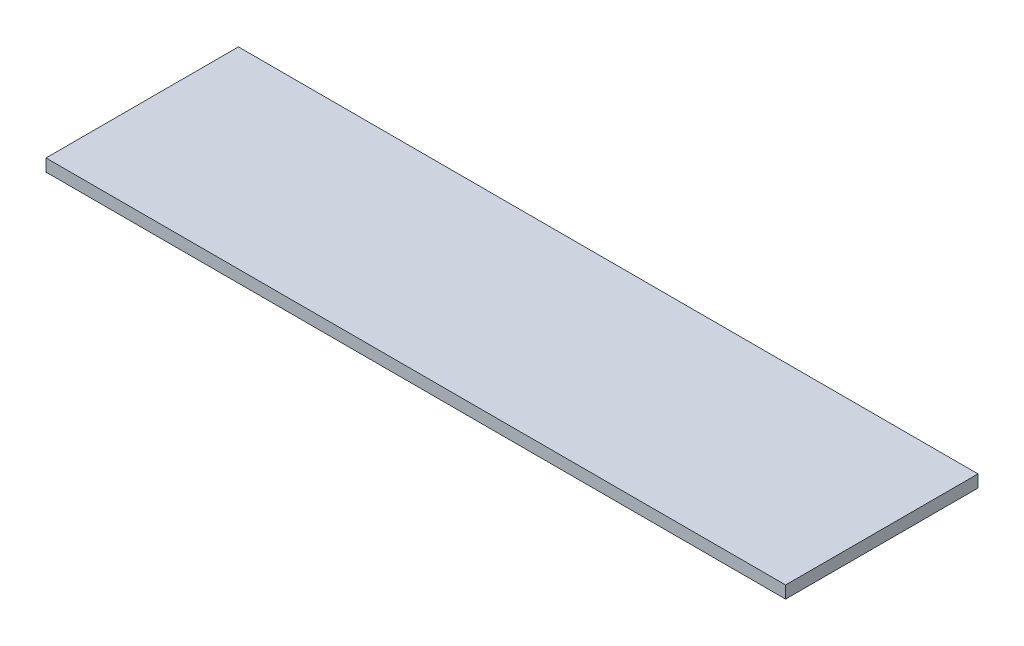
ISO-10303-21;
HEADER;
FILE_DESCRIPTION(('STEP AP214'),'2;1');
FILE_NAME('part.step','',(''),(''),'','','');
FILE_SCHEMA(('AUTOMOTIVE_DESIGN { 1 0 10303 214 1 1 1 1 }'));
ENDSEC;
DATA;
#1=APPLICATION_CONTEXT('core data for automotive mechanical design processes');
#2=APPLICATION_PROTOCOL_DEFINITION('international standard','automotive_design',2000,#1);
#3=PRODUCT_CONTEXT('',#1,'mechanical');
#4=PRODUCT('Part','Part','',(#3));
#5=PRODUCT_RELATED_PRODUCT_CATEGORY('part','',(#4));
#6=PRODUCT_DEFINITION_FORMATION('','',#4);
#7=PRODUCT_DEFINITION_CONTEXT('part definition',#1,'design');
#8=PRODUCT_DEFINITION('design','',#6,#7);
#9=PRODUCT_DEFINITION_SHAPE('','',#8);
#10=(LENGTH_UNIT() NAMED_UNIT(*) SI_UNIT(.MILLI.,.METRE.));
#11=(NAMED_UNIT(*) PLANE_ANGLE_UNIT() SI_UNIT($,.RADIAN.));
#12=(NAMED_UNIT(*) SI_UNIT($,.STERADIAN.) SOLID_ANGLE_UNIT());
#13=UNCERTAINTY_MEASURE_WITH_UNIT(LENGTH_MEASURE(1.E-05),#10,'distance_accuracy_value','');
#14=(GEOMETRIC_REPRESENTATION_CONTEXT(3) GLOBAL_UNCERTAINTY_ASSIGNED_CONTEXT((#13)) GLOBAL_UNIT_ASSIGNED_CONTEXT((#10,
#11,#12)) REPRESENTATION_CONTEXT('',''));
#15=CARTESIAN_POINT('',(0.,0.,0.));
#16=DIRECTION('',(0.,0.,1.));
#17=DIRECTION('',(1.,0.,0.));
#18=AXIS2_PLACEMENT_3D('',#15,#16,#17);
#19=CARTESIAN_POINT('',(-542.,18.,141.));
#20=DIRECTION('',(1.,0.,0.));
#21=DIRECTION('',(0.,0.,-1.));
#22=AXIS2_PLACEMENT_3D('',#19,#20,#21);
#23=PLANE('',#22);
#24=DIRECTION('',(0.,0.,1.));
#25=VECTOR('',#24,1.);
#26=CARTESIAN_POINT('',(-542.,0.,141.));
#27=LINE('',#26,#25);
#28=CARTESIAN_POINT('',(-542.,0.,-141.));
#29=VERTEX_POINT('',#28);
#30=CARTESIAN_POINT('',(-542.,0.,141.));
#31=VERTEX_POINT('',#30);
#32=EDGE_CURVE('E98',#29,#31,#27,.T.);
#33=ORIENTED_EDGE('',*,*,#32,.T.);
#34=DIRECTION('',(0.,-1.,0.));
#35=VECTOR('',#34,1.);
#36=CARTESIAN_POINT('',(-542.,18.,141.));
#37=LINE('',#36,#35);
#38=CARTESIAN_POINT('',(-542.,18.,141.));
#39=VERTEX_POINT('',#38);
#40=EDGE_CURVE('E11',#39,#31,#37,.T.);
#41=ORIENTED_EDGE('',*,*,#40,.F.);
#42=DIRECTION('',(0.,0.,1.));
#43=VECTOR('',#42,1.);
#44=CARTESIAN_POINT('',(-542.,18.,141.));
#45=LINE('',#44,#43);
#46=CARTESIAN_POINT('',(-542.,18.,-141.));
#47=VERTEX_POINT('',#46);
#48=EDGE_CURVE('E86',#47,#39,#45,.T.);
#49=ORIENTED_EDGE('',*,*,#48,.F.);
#50=DIRECTION('',(0.,-1.,0.));
#51=VECTOR('',#50,1.);
#52=CARTESIAN_POINT('',(-542.,18.,-141.));
#53=LINE('',#52,#51);
#54=EDGE_CURVE('E94',#47,#29,#53,.T.);
#55=ORIENTED_EDGE('',*,*,#54,.T.);
#56=EDGE_LOOP('',(#33,#41,#49,#55));
#57=FACE_BOUND('',#56,.T.);
#58=ADVANCED_FACE('F35',(#57),#23,.F.);
#59=CARTESIAN_POINT('',(542.,18.,141.));
#60=DIRECTION('',(0.,0.,-1.));
#61=DIRECTION('',(-1.,0.,0.));
#62=AXIS2_PLACEMENT_3D('',#59,#60,#61);
#63=PLANE('',#62);
#64=DIRECTION('',(1.,0.,0.));
#65=VECTOR('',#64,1.);
#66=CARTESIAN_POINT('',(542.,0.,141.));
#67=LINE('',#66,#65);
#68=CARTESIAN_POINT('',(542.,0.,141.));
#69=VERTEX_POINT('',#68);
#70=EDGE_CURVE('E90',#31,#69,#67,.T.);
#71=ORIENTED_EDGE('',*,*,#70,.T.);
#72=DIRECTION('',(0.,-1.,0.));
#73=VECTOR('',#72,1.);
#74=CARTESIAN_POINT('',(542.,18.,141.));
#75=LINE('',#74,#73);
#76=CARTESIAN_POINT('',(542.,18.,141.));
#77=VERTEX_POINT('',#76);
#78=EDGE_CURVE('E43',#77,#69,#75,.T.);
#79=ORIENTED_EDGE('',*,*,#78,.F.);
#80=DIRECTION('',(1.,0.,0.));
#81=VECTOR('',#80,1.);
#82=CARTESIAN_POINT('',(542.,18.,141.));
#83=LINE('',#82,#81);
#84=EDGE_CURVE('E81',#39,#77,#83,.T.);
#85=ORIENTED_EDGE('',*,*,#84,.F.);
#86=ORIENTED_EDGE('',*,*,#40,.T.);
#87=EDGE_LOOP('',(#71,#79,#85,#86));
#88=FACE_BOUND('',#87,.T.);
#89=ADVANCED_FACE('F89',(#88),#63,.F.);
#90=CARTESIAN_POINT('',(542.,18.,141.));
#91=DIRECTION('',(-1.,0.,0.));
#92=DIRECTION('',(0.,0.,1.));
#93=AXIS2_PLACEMENT_3D('',#90,#91,#92);
#94=PLANE('',#93);
#95=DIRECTION('',(0.,0.,-1.));
#96=VECTOR('',#95,1.);
#97=CARTESIAN_POINT('',(542.,0.,141.));
#98=LINE('',#97,#96);
#99=CARTESIAN_POINT('',(542.,0.,-141.));
#100=VERTEX_POINT('',#99);
#101=EDGE_CURVE('E68',#69,#100,#98,.T.);
#102=ORIENTED_EDGE('',*,*,#101,.T.);
#103=DIRECTION('',(0.,-1.,0.));
#104=VECTOR('',#103,1.);
#105=CARTESIAN_POINT('',(542.,18.,-141.));
#106=LINE('',#105,#104);
#107=CARTESIAN_POINT('',(542.,18.,-141.));
#108=VERTEX_POINT('',#107);
#109=EDGE_CURVE('E91',#108,#100,#106,.T.);
#110=ORIENTED_EDGE('',*,*,#109,.F.);
#111=DIRECTION('',(0.,0.,-1.));
#112=VECTOR('',#111,1.);
#113=CARTESIAN_POINT('',(542.,18.,141.));
#114=LINE('',#113,#112);
#115=EDGE_CURVE('E84',#77,#108,#114,.T.);
#116=ORIENTED_EDGE('',*,*,#115,.F.);
#117=ORIENTED_EDGE('',*,*,#78,.T.);
#118=EDGE_LOOP('',(#102,#110,#116,#117));
#119=FACE_BOUND('',#118,.T.);
#120=ADVANCED_FACE('F92',(#119),#94,.F.);
#121=CARTESIAN_POINT('',(542.,18.,-141.));
#122=DIRECTION('',(0.,0.,1.));
#123=DIRECTION('',(1.,0.,0.));
#124=AXIS2_PLACEMENT_3D('',#121,#122,#123);
#125=PLANE('',#124);
#126=DIRECTION('',(-1.,0.,0.));
#127=VECTOR('',#126,1.);
#128=CARTESIAN_POINT('',(542.,0.,-141.));
#129=LINE('',#128,#127);
#130=EDGE_CURVE('E74',#100,#29,#129,.T.);
#131=ORIENTED_EDGE('',*,*,#130,.T.);
#132=ORIENTED_EDGE('',*,*,#54,.F.);
#133=DIRECTION('',(-1.,0.,0.));
#134=VECTOR('',#133,1.);
#135=CARTESIAN_POINT('',(542.,18.,-141.));
#136=LINE('',#135,#134);
#137=EDGE_CURVE('E51',#108,#47,#136,.T.);
#138=ORIENTED_EDGE('',*,*,#137,.F.);
#139=ORIENTED_EDGE('',*,*,#109,.T.);
#140=EDGE_LOOP('',(#131,#132,#138,#139));
#141=FACE_BOUND('',#140,.T.);
#142=ADVANCED_FACE('F105',(#141),#125,.F.);
#143=CARTESIAN_POINT('',(0.,18.,0.));
#144=DIRECTION('',(0.,1.,0.));
#145=DIRECTION('',(0.,0.,1.));
#146=AXIS2_PLACEMENT_3D('',#143,#144,#145);
#147=PLANE('',#146);
#148=ORIENTED_EDGE('',*,*,#48,.T.);
#149=ORIENTED_EDGE('',*,*,#84,.T.);
#150=ORIENTED_EDGE('',*,*,#115,.T.);
#151=ORIENTED_EDGE('',*,*,#137,.T.);
#152=EDGE_LOOP('',(#148,#149,#150,#151));
#153=FACE_BOUND('',#152,.T.);
#154=ADVANCED_FACE('F82',(#153),#147,.T.);
#155=CARTESIAN_POINT('',(0.,0.,0.));
#156=DIRECTION('',(0.,1.,0.));
#157=DIRECTION('',(0.,0.,1.));
#158=AXIS2_PLACEMENT_3D('',#155,#156,#157);
#159=PLANE('',#158);
#160=ORIENTED_EDGE('',*,*,#32,.F.);
#161=ORIENTED_EDGE('',*,*,#130,.F.);
#162=ORIENTED_EDGE('',*,*,#101,.F.);
#163=ORIENTED_EDGE('',*,*,#70,.F.);
#164=EDGE_LOOP('',(#160,#161,#162,#163));
#165=FACE_BOUND('',#164,.T.);
#166=ADVANCED_FACE('F108',(#165),#159,.F.);
#167=CLOSED_SHELL('',(#58,#89,#120,#142,#154,#166));
#168=MANIFOLD_SOLID_BREP('B2',#167);
#169=ADVANCED_BREP_SHAPE_REPRESENTATION('',(#18,#168),#14);
#170=SHAPE_DEFINITION_REPRESENTATION(#9,#169);
ENDSEC;
END-ISO-10303-21;
